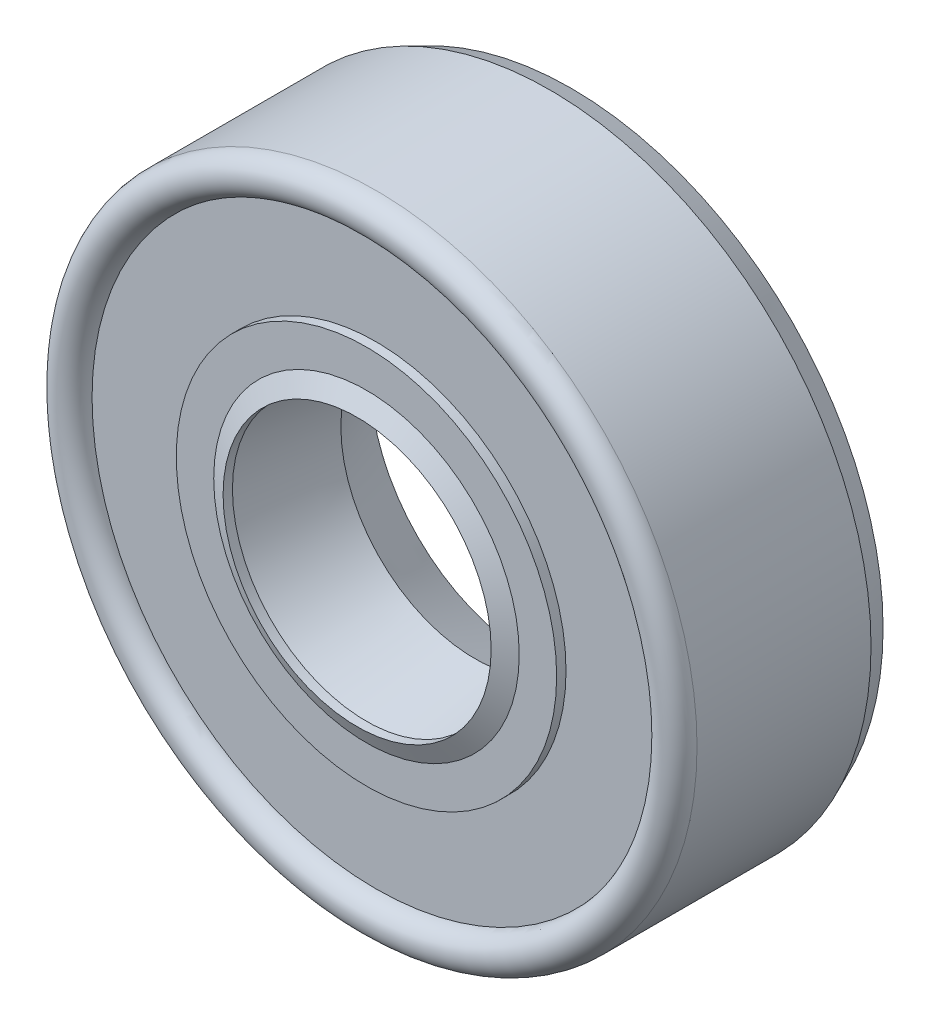
ISO-10303-21;
HEADER;
FILE_DESCRIPTION(('STEP AP214'),'2;1');
FILE_NAME('part.step','',(''),(''),'','','');
FILE_SCHEMA(('AUTOMOTIVE_DESIGN { 1 0 10303 214 1 1 1 1 }'));
ENDSEC;
DATA;
#1=APPLICATION_CONTEXT('core data for automotive mechanical design processes');
#2=APPLICATION_PROTOCOL_DEFINITION('international standard','automotive_design',2000,#1);
#3=PRODUCT_CONTEXT('',#1,'mechanical');
#4=PRODUCT('Part','Part','',(#3));
#5=PRODUCT_RELATED_PRODUCT_CATEGORY('part','',(#4));
#6=PRODUCT_DEFINITION_FORMATION('','',#4);
#7=PRODUCT_DEFINITION_CONTEXT('part definition',#1,'design');
#8=PRODUCT_DEFINITION('design','',#6,#7);
#9=PRODUCT_DEFINITION_SHAPE('','',#8);
#10=(LENGTH_UNIT() NAMED_UNIT(*) SI_UNIT(.MILLI.,.METRE.));
#11=(NAMED_UNIT(*) PLANE_ANGLE_UNIT() SI_UNIT($,.RADIAN.));
#12=(NAMED_UNIT(*) SI_UNIT($,.STERADIAN.) SOLID_ANGLE_UNIT());
#13=UNCERTAINTY_MEASURE_WITH_UNIT(LENGTH_MEASURE(1.E-05),#10,'distance_accuracy_value','');
#14=(GEOMETRIC_REPRESENTATION_CONTEXT(3) GLOBAL_UNCERTAINTY_ASSIGNED_CONTEXT((#13)) GLOBAL_UNIT_ASSIGNED_CONTEXT((#10,
#11,#12)) REPRESENTATION_CONTEXT('',''));
#15=CARTESIAN_POINT('',(0.,0.,0.));
#16=DIRECTION('',(0.,0.,1.));
#17=DIRECTION('',(1.,0.,0.));
#18=AXIS2_PLACEMENT_3D('',#15,#16,#17);
#19=CARTESIAN_POINT('',(0.,0.,-0.35750500000001));
#20=DIRECTION('',(0.,0.,1.));
#21=DIRECTION('',(0.,-1.,0.));
#22=AXIS2_PLACEMENT_3D('',#19,#20,#21);
#23=TOROIDAL_SURFACE('',#22,5.08507999999999,0.554989999999971);
#24=CARTESIAN_POINT('',(0.,-5.64006999999996,-0.35750500000001));
#25=VERTEX_POINT('',#24);
#26=VERTEX_LOOP('',#25);
#27=FACE_BOUND('',#26,.T.);
#28=ADVANCED_FACE('F45',(#27),#23,.T.);
#29=CLOSED_SHELL('',(#28));
#30=MANIFOLD_SOLID_BREP('B2',#29);
#31=CARTESIAN_POINT('',(0.,0.,2.85750000000001));
#32=DIRECTION('',(0.,0.,-1.));
#33=DIRECTION('',(-1.,0.,0.));
#34=AXIS2_PLACEMENT_3D('',#31,#32,#33);
#35=CONICAL_SURFACE('',#34,4.53009,1.10714871779412);
#36=CARTESIAN_POINT('',(0.,0.,3.13499499999999));
#37=DIRECTION('',(0.,0.,1.));
#38=DIRECTION('',(1.,0.,0.));
#39=AXIS2_PLACEMENT_3D('',#36,#37,#38);
#40=CIRCLE('',#39,3.9751);
#41=CARTESIAN_POINT('',(3.9751,0.,3.13499499999999));
#42=VERTEX_POINT('',#41);
#43=EDGE_CURVE('E44',#42,#42,#40,.T.);
#44=ORIENTED_EDGE('',*,*,#43,.F.);
#45=EDGE_LOOP('',(#44));
#46=FACE_BOUND('',#45,.T.);
#47=CARTESIAN_POINT('',(0.,0.,2.85750000000001));
#48=DIRECTION('',(0.,0.,1.));
#49=DIRECTION('',(1.,0.,0.));
#50=AXIS2_PLACEMENT_3D('',#47,#48,#49);
#51=CIRCLE('',#50,4.53009);
#52=CARTESIAN_POINT('',(4.53009,0.,2.85750000000001));
#53=VERTEX_POINT('',#52);
#54=EDGE_CURVE('E136',#53,#53,#51,.T.);
#55=ORIENTED_EDGE('',*,*,#54,.T.);
#56=EDGE_LOOP('',(#55));
#57=FACE_BOUND('',#56,.T.);
#58=ADVANCED_FACE('F66',(#46,#57),#35,.T.);
#59=CARTESIAN_POINT('',(0.,0.,-3.13499499999999));
#60=DIRECTION('',(0.,0.,1.));
#61=DIRECTION('',(1.,0.,0.));
#62=AXIS2_PLACEMENT_3D('',#59,#60,#61);
#63=CYLINDRICAL_SURFACE('',#62,3.9751);
#64=CARTESIAN_POINT('',(0.,0.,2.85749999999998));
#65=DIRECTION('',(0.,0.,1.));
#66=DIRECTION('',(1.,0.,0.));
#67=AXIS2_PLACEMENT_3D('',#64,#65,#66);
#68=CIRCLE('',#67,3.97509999999999);
#69=CARTESIAN_POINT('',(3.97509999999999,0.,2.85749999999998));
#70=VERTEX_POINT('',#69);
#71=EDGE_CURVE('E72',#70,#70,#68,.T.);
#72=ORIENTED_EDGE('',*,*,#71,.F.);
#73=EDGE_LOOP('',(#72));
#74=FACE_BOUND('',#73,.T.);
#75=ORIENTED_EDGE('',*,*,#43,.T.);
#76=EDGE_LOOP('',(#75));
#77=FACE_BOUND('',#76,.T.);
#78=ADVANCED_FACE('F257',(#74,#77),#63,.F.);
#79=CARTESIAN_POINT('',(0.,0.,2.85749999999998));
#80=DIRECTION('',(0.,0.,-1.));
#81=DIRECTION('',(-1.,0.,0.));
#82=AXIS2_PLACEMENT_3D('',#79,#80,#81);
#83=CONICAL_SURFACE('',#82,3.97509999999999,1.10714871779412);
#84=CARTESIAN_POINT('',(0.,0.,2.58000500000002));
#85=DIRECTION('',(0.,0.,1.));
#86=DIRECTION('',(1.,0.,0.));
#87=AXIS2_PLACEMENT_3D('',#84,#85,#86);
#88=CIRCLE('',#87,4.53008999999996);
#89=CARTESIAN_POINT('',(4.53008999999996,0.,2.58000500000002));
#90=VERTEX_POINT('',#89);
#91=EDGE_CURVE('E76',#90,#90,#88,.T.);
#92=ORIENTED_EDGE('',*,*,#91,.F.);
#93=EDGE_LOOP('',(#92));
#94=FACE_BOUND('',#93,.T.);
#95=ORIENTED_EDGE('',*,*,#71,.T.);
#96=EDGE_LOOP('',(#95));
#97=FACE_BOUND('',#96,.T.);
#98=ADVANCED_FACE('F252',(#94,#97),#83,.F.);
#99=CARTESIAN_POINT('',(0.,0.,2.58000500000002));
#100=DIRECTION('',(0.,0.,1.));
#101=DIRECTION('',(1.,0.,0.));
#102=AXIS2_PLACEMENT_3D('',#99,#100,#101);
#103=CONICAL_SURFACE('',#102,4.53008999999996,0.186731074978148);
#104=CARTESIAN_POINT('',(0.,0.,-0.357505000000009));
#105=DIRECTION('',(0.,0.,1.));
#106=DIRECTION('',(1.,0.,0.));
#107=AXIS2_PLACEMENT_3D('',#104,#105,#106);
#108=CIRCLE('',#107,3.97509999999999);
#109=CARTESIAN_POINT('',(3.97509999999999,0.,-0.357505000000009));
#110=VERTEX_POINT('',#109);
#111=EDGE_CURVE('E80',#110,#110,#108,.T.);
#112=ORIENTED_EDGE('',*,*,#111,.F.);
#113=EDGE_LOOP('',(#112));
#114=FACE_BOUND('',#113,.T.);
#115=ORIENTED_EDGE('',*,*,#91,.T.);
#116=EDGE_LOOP('',(#115));
#117=FACE_BOUND('',#116,.T.);
#118=ADVANCED_FACE('F246',(#114,#117),#103,.F.);
#119=CARTESIAN_POINT('',(0.,0.,-0.357505000000009));
#120=DIRECTION('',(0.,0.,-1.));
#121=DIRECTION('',(-1.,0.,0.));
#122=AXIS2_PLACEMENT_3D('',#119,#120,#121);
#123=CONICAL_SURFACE('',#122,3.97509999999999,0.453924654369483);
#124=CARTESIAN_POINT('',(0.,0.,-2.06374999999999));
#125=DIRECTION('',(0.,0.,1.));
#126=DIRECTION('',(1.,0.,0.));
#127=AXIS2_PLACEMENT_3D('',#124,#125,#126);
#128=CIRCLE('',#127,4.80758499999999);
#129=CARTESIAN_POINT('',(4.80758499999999,0.,-2.06374999999999));
#130=VERTEX_POINT('',#129);
#131=EDGE_CURVE('E85',#130,#130,#128,.T.);
#132=ORIENTED_EDGE('',*,*,#131,.F.);
#133=EDGE_LOOP('',(#132));
#134=FACE_BOUND('',#133,.T.);
#135=ORIENTED_EDGE('',*,*,#111,.T.);
#136=EDGE_LOOP('',(#135));
#137=FACE_BOUND('',#136,.T.);
#138=ADVANCED_FACE('F240',(#134,#137),#123,.F.);
#139=CARTESIAN_POINT('',(0.,4.80758499999999,-2.06374999999999));
#140=DIRECTION('',(0.,0.,1.));
#141=DIRECTION('',(1.,0.,0.));
#142=AXIS2_PLACEMENT_3D('',#139,#140,#141);
#143=PLANE('',#142);
#144=CARTESIAN_POINT('',(0.,0.,-2.06374999999999));
#145=DIRECTION('',(0.,0.,1.));
#146=DIRECTION('',(1.,0.,0.));
#147=AXIS2_PLACEMENT_3D('',#144,#145,#146);
#148=CIRCLE('',#147,5.08507999999999);
#149=CARTESIAN_POINT('',(5.08507999999999,0.,-2.06374999999999));
#150=VERTEX_POINT('',#149);
#151=EDGE_CURVE('E88',#150,#150,#148,.T.);
#152=ORIENTED_EDGE('',*,*,#151,.F.);
#153=EDGE_LOOP('',(#152));
#154=FACE_BOUND('',#153,.T.);
#155=ORIENTED_EDGE('',*,*,#131,.T.);
#156=EDGE_LOOP('',(#155));
#157=FACE_BOUND('',#156,.T.);
#158=ADVANCED_FACE('F234',(#154,#157),#143,.F.);
#159=CARTESIAN_POINT('',(0.,0.,-3.13499499999999));
#160=DIRECTION('',(0.,0.,1.));
#161=DIRECTION('',(1.,0.,0.));
#162=AXIS2_PLACEMENT_3D('',#159,#160,#161);
#163=CYLINDRICAL_SURFACE('',#162,5.08507999999999);
#164=CARTESIAN_POINT('',(0.,0.,-0.91249499999998));
#165=DIRECTION('',(0.,0.,1.));
#166=DIRECTION('',(1.,0.,0.));
#167=AXIS2_PLACEMENT_3D('',#164,#165,#166);
#168=CIRCLE('',#167,5.08507999999999);
#169=CARTESIAN_POINT('',(5.08507999999999,0.,-0.91249499999998));
#170=VERTEX_POINT('',#169);
#171=EDGE_CURVE('E91',#170,#170,#168,.T.);
#172=ORIENTED_EDGE('',*,*,#171,.F.);
#173=EDGE_LOOP('',(#172));
#174=FACE_BOUND('',#173,.T.);
#175=ORIENTED_EDGE('',*,*,#151,.T.);
#176=EDGE_LOOP('',(#175));
#177=FACE_BOUND('',#176,.T.);
#178=ADVANCED_FACE('F228',(#174,#177),#163,.T.);
#179=CARTESIAN_POINT('',(0.,0.,-0.357505000000009));
#180=DIRECTION('',(0.,0.,1.));
#181=DIRECTION('',(1.,0.,0.));
#182=AXIS2_PLACEMENT_3D('',#179,#180,#181);
#183=TOROIDAL_SURFACE('',#182,5.08507999999999,0.554989999999971);
#184=CARTESIAN_POINT('',(0.,0.,0.197484999999962));
#185=DIRECTION('',(0.,0.,1.));
#186=DIRECTION('',(1.,0.,0.));
#187=AXIS2_PLACEMENT_3D('',#184,#185,#186);
#188=CIRCLE('',#187,5.08507999999999);
#189=CARTESIAN_POINT('',(5.08507999999999,0.,0.197484999999962));
#190=VERTEX_POINT('',#189);
#191=EDGE_CURVE('E94',#190,#190,#188,.T.);
#192=ORIENTED_EDGE('',*,*,#191,.F.);
#193=EDGE_LOOP('',(#192));
#194=FACE_BOUND('',#193,.T.);
#195=ORIENTED_EDGE('',*,*,#171,.T.);
#196=EDGE_LOOP('',(#195));
#197=FACE_BOUND('',#196,.T.);
#198=ADVANCED_FACE('F222',(#194,#197),#183,.F.);
#199=CARTESIAN_POINT('',(0.,0.,-3.13499499999999));
#200=DIRECTION('',(0.,0.,1.));
#201=DIRECTION('',(1.,0.,0.));
#202=AXIS2_PLACEMENT_3D('',#199,#200,#201);
#203=CYLINDRICAL_SURFACE('',#202,5.08507999999999);
#204=CARTESIAN_POINT('',(0.,0.,2.02501500000003));
#205=DIRECTION('',(0.,0.,1.));
#206=DIRECTION('',(1.,0.,0.));
#207=AXIS2_PLACEMENT_3D('',#204,#205,#206);
#208=CIRCLE('',#207,5.08507999999999);
#209=CARTESIAN_POINT('',(5.08507999999999,0.,2.02501500000003));
#210=VERTEX_POINT('',#209);
#211=EDGE_CURVE('E97',#210,#210,#208,.T.);
#212=ORIENTED_EDGE('',*,*,#211,.F.);
#213=EDGE_LOOP('',(#212));
#214=FACE_BOUND('',#213,.T.);
#215=ORIENTED_EDGE('',*,*,#191,.T.);
#216=EDGE_LOOP('',(#215));
#217=FACE_BOUND('',#216,.T.);
#218=ADVANCED_FACE('F216',(#214,#217),#203,.T.);
#219=CARTESIAN_POINT('',(0.,5.08507999999999,2.02501500000003));
#220=DIRECTION('',(0.,0.,1.));
#221=DIRECTION('',(1.,0.,0.));
#222=AXIS2_PLACEMENT_3D('',#219,#220,#221);
#223=PLANE('',#222);
#224=CARTESIAN_POINT('',(0.,0.,2.02501500000003));
#225=DIRECTION('',(0.,0.,1.));
#226=DIRECTION('',(1.,0.,0.));
#227=AXIS2_PLACEMENT_3D('',#224,#225,#226);
#228=CIRCLE('',#227,8.97001000000001);
#229=CARTESIAN_POINT('',(8.97001000000001,0.,2.02501500000003));
#230=VERTEX_POINT('',#229);
#231=EDGE_CURVE('E100',#230,#230,#228,.T.);
#232=ORIENTED_EDGE('',*,*,#231,.F.);
#233=EDGE_LOOP('',(#232));
#234=FACE_BOUND('',#233,.T.);
#235=ORIENTED_EDGE('',*,*,#211,.T.);
#236=EDGE_LOOP('',(#235));
#237=FACE_BOUND('',#236,.T.);
#238=ADVANCED_FACE('F210',(#234,#237),#223,.F.);
#239=CARTESIAN_POINT('',(0.,0.,-3.13499499999999));
#240=DIRECTION('',(0.,0.,1.));
#241=DIRECTION('',(1.,0.,0.));
#242=AXIS2_PLACEMENT_3D('',#239,#240,#241);
#243=CYLINDRICAL_SURFACE('',#242,8.97001);
#244=CARTESIAN_POINT('',(0.,0.,-1.94500500000001));
#245=DIRECTION('',(0.,0.,1.));
#246=DIRECTION('',(1.,0.,0.));
#247=AXIS2_PLACEMENT_3D('',#244,#245,#246);
#248=CIRCLE('',#247,8.97000999999999);
#249=CARTESIAN_POINT('',(8.97000999999999,0.,-1.94500500000001));
#250=VERTEX_POINT('',#249);
#251=EDGE_CURVE('E103',#250,#250,#248,.T.);
#252=ORIENTED_EDGE('',*,*,#251,.F.);
#253=EDGE_LOOP('',(#252));
#254=FACE_BOUND('',#253,.T.);
#255=ORIENTED_EDGE('',*,*,#231,.T.);
#256=EDGE_LOOP('',(#255));
#257=FACE_BOUND('',#256,.T.);
#258=ADVANCED_FACE('F204',(#254,#257),#243,.F.);
#259=CARTESIAN_POINT('',(0.,8.97000999999999,-1.94500500000001));
#260=DIRECTION('',(0.,0.,1.));
#261=DIRECTION('',(1.,0.,0.));
#262=AXIS2_PLACEMENT_3D('',#259,#260,#261);
#263=PLANE('',#262);
#264=CARTESIAN_POINT('',(0.,0.,-1.94500500000001));
#265=DIRECTION('',(0.,0.,1.));
#266=DIRECTION('',(1.,0.,0.));
#267=AXIS2_PLACEMENT_3D('',#264,#265,#266);
#268=CIRCLE('',#267,9.1087575);
#269=CARTESIAN_POINT('',(9.1087575,0.,-1.94500500000001));
#270=VERTEX_POINT('',#269);
#271=EDGE_CURVE('E106',#270,#270,#268,.T.);
#272=ORIENTED_EDGE('',*,*,#271,.F.);
#273=EDGE_LOOP('',(#272));
#274=FACE_BOUND('',#273,.T.);
#275=ORIENTED_EDGE('',*,*,#251,.T.);
#276=EDGE_LOOP('',(#275));
#277=FACE_BOUND('',#276,.T.);
#278=ADVANCED_FACE('F198',(#274,#277),#263,.F.);
#279=CARTESIAN_POINT('',(0.,0.,-3.13499499999999));
#280=DIRECTION('',(0.,0.,1.));
#281=DIRECTION('',(1.,0.,0.));
#282=AXIS2_PLACEMENT_3D('',#279,#280,#281);
#283=CYLINDRICAL_SURFACE('',#282,9.1087575);
#284=CARTESIAN_POINT('',(0.,0.,-2.58000500000001));
#285=DIRECTION('',(0.,0.,1.));
#286=DIRECTION('',(1.,0.,0.));
#287=AXIS2_PLACEMENT_3D('',#284,#285,#286);
#288=CIRCLE('',#287,9.1087575);
#289=CARTESIAN_POINT('',(9.1087575,0.,-2.58000500000001));
#290=VERTEX_POINT('',#289);
#291=EDGE_CURVE('E109',#290,#290,#288,.T.);
#292=ORIENTED_EDGE('',*,*,#291,.F.);
#293=EDGE_LOOP('',(#292));
#294=FACE_BOUND('',#293,.T.);
#295=ORIENTED_EDGE('',*,*,#271,.T.);
#296=EDGE_LOOP('',(#295));
#297=FACE_BOUND('',#296,.T.);
#298=ADVANCED_FACE('F192',(#294,#297),#283,.F.);
#299=CARTESIAN_POINT('',(0.,9.1087575,-2.58000500000002));
#300=DIRECTION('',(0.,0.,-1.));
#301=DIRECTION('',(-1.,0.,0.));
#302=AXIS2_PLACEMENT_3D('',#299,#300,#301);
#303=PLANE('',#302);
#304=CARTESIAN_POINT('',(0.,0.,-2.58000500000002));
#305=DIRECTION('',(0.,0.,1.));
#306=DIRECTION('',(1.,0.,0.));
#307=AXIS2_PLACEMENT_3D('',#304,#305,#306);
#308=CIRCLE('',#307,8.97000999999999);
#309=CARTESIAN_POINT('',(8.97000999999999,0.,-2.58000500000002));
#310=VERTEX_POINT('',#309);
#311=EDGE_CURVE('E112',#310,#310,#308,.T.);
#312=ORIENTED_EDGE('',*,*,#311,.F.);
#313=EDGE_LOOP('',(#312));
#314=FACE_BOUND('',#313,.T.);
#315=ORIENTED_EDGE('',*,*,#291,.T.);
#316=EDGE_LOOP('',(#315));
#317=FACE_BOUND('',#316,.T.);
#318=ADVANCED_FACE('F186',(#314,#317),#303,.F.);
#319=CARTESIAN_POINT('',(0.,0.,-3.13499499999999));
#320=DIRECTION('',(0.,0.,1.));
#321=DIRECTION('',(1.,0.,0.));
#322=AXIS2_PLACEMENT_3D('',#319,#320,#321);
#323=CYLINDRICAL_SURFACE('',#322,8.97001);
#324=CARTESIAN_POINT('',(0.,0.,-3.21500500000001));
#325=DIRECTION('',(0.,0.,1.));
#326=DIRECTION('',(1.,0.,0.));
#327=AXIS2_PLACEMENT_3D('',#324,#325,#326);
#328=CIRCLE('',#327,8.97001);
#329=CARTESIAN_POINT('',(8.97001,0.,-3.21500500000001));
#330=VERTEX_POINT('',#329);
#331=EDGE_CURVE('E115',#330,#330,#328,.T.);
#332=ORIENTED_EDGE('',*,*,#331,.F.);
#333=EDGE_LOOP('',(#332));
#334=FACE_BOUND('',#333,.T.);
#335=ORIENTED_EDGE('',*,*,#311,.T.);
#336=EDGE_LOOP('',(#335));
#337=FACE_BOUND('',#336,.T.);
#338=ADVANCED_FACE('F180',(#334,#337),#323,.F.);
#339=CARTESIAN_POINT('',(0.,8.97001,-3.21500500000001));
#340=DIRECTION('',(0.,0.,1.));
#341=DIRECTION('',(1.,0.,0.));
#342=AXIS2_PLACEMENT_3D('',#339,#340,#341);
#343=PLANE('',#342);
#344=CARTESIAN_POINT('',(0.,0.,-3.21500500000001));
#345=DIRECTION('',(0.,0.,1.));
#346=DIRECTION('',(1.,0.,0.));
#347=AXIS2_PLACEMENT_3D('',#344,#345,#346);
#348=CIRCLE('',#347,9.247505);
#349=CARTESIAN_POINT('',(9.247505,0.,-3.21500500000001));
#350=VERTEX_POINT('',#349);
#351=EDGE_CURVE('E118',#350,#350,#348,.T.);
#352=ORIENTED_EDGE('',*,*,#351,.F.);
#353=EDGE_LOOP('',(#352));
#354=FACE_BOUND('',#353,.T.);
#355=ORIENTED_EDGE('',*,*,#331,.T.);
#356=EDGE_LOOP('',(#355));
#357=FACE_BOUND('',#356,.T.);
#358=ADVANCED_FACE('F174',(#354,#357),#343,.F.);
#359=CARTESIAN_POINT('',(0.,0.,-3.21500500000001));
#360=DIRECTION('',(0.,0.,1.));
#361=DIRECTION('',(1.,0.,0.));
#362=AXIS2_PLACEMENT_3D('',#359,#360,#361);
#363=CONICAL_SURFACE('',#362,9.247505,0.411990692422189);
#364=CARTESIAN_POINT('',(0.,0.,-2.58000500000004));
#365=DIRECTION('',(0.,0.,1.));
#366=DIRECTION('',(1.,0.,0.));
#367=AXIS2_PLACEMENT_3D('',#364,#365,#366);
#368=CIRCLE('',#367,9.52499999999999);
#369=CARTESIAN_POINT('',(9.52499999999999,0.,-2.58000500000004));
#370=VERTEX_POINT('',#369);
#371=EDGE_CURVE('E121',#370,#370,#368,.T.);
#372=ORIENTED_EDGE('',*,*,#371,.F.);
#373=EDGE_LOOP('',(#372));
#374=FACE_BOUND('',#373,.T.);
#375=ORIENTED_EDGE('',*,*,#351,.T.);
#376=EDGE_LOOP('',(#375));
#377=FACE_BOUND('',#376,.T.);
#378=ADVANCED_FACE('F168',(#374,#377),#363,.T.);
#379=CARTESIAN_POINT('',(0.,0.,-3.13499499999999));
#380=DIRECTION('',(0.,0.,1.));
#381=DIRECTION('',(1.,0.,0.));
#382=AXIS2_PLACEMENT_3D('',#379,#380,#381);
#383=CYLINDRICAL_SURFACE('',#382,9.52499999999999);
#384=CARTESIAN_POINT('',(0.,0.,2.58000500000003));
#385=DIRECTION('',(0.,0.,1.));
#386=DIRECTION('',(1.,0.,0.));
#387=AXIS2_PLACEMENT_3D('',#384,#385,#386);
#388=CIRCLE('',#387,9.52499999999999);
#389=CARTESIAN_POINT('',(9.52499999999999,0.,2.58000500000003));
#390=VERTEX_POINT('',#389);
#391=EDGE_CURVE('E124',#390,#390,#388,.T.);
#392=ORIENTED_EDGE('',*,*,#391,.F.);
#393=EDGE_LOOP('',(#392));
#394=FACE_BOUND('',#393,.T.);
#395=ORIENTED_EDGE('',*,*,#371,.T.);
#396=EDGE_LOOP('',(#395));
#397=FACE_BOUND('',#396,.T.);
#398=ADVANCED_FACE('F162',(#394,#397),#383,.T.);
#399=CARTESIAN_POINT('',(0.,0.,2.58000500000001));
#400=DIRECTION('',(0.,0.,1.));
#401=DIRECTION('',(1.,0.,0.));
#402=AXIS2_PLACEMENT_3D('',#399,#400,#401);
#403=TOROIDAL_SURFACE('',#402,8.97000999999999,0.554989999999983);
#404=CARTESIAN_POINT('',(0.,0.,2.58000500000003));
#405=DIRECTION('',(0.,0.,1.));
#406=DIRECTION('',(1.,0.,0.));
#407=AXIS2_PLACEMENT_3D('',#404,#405,#406);
#408=CIRCLE('',#407,8.41502000000001);
#409=CARTESIAN_POINT('',(8.41502000000001,0.,2.58000500000003));
#410=VERTEX_POINT('',#409);
#411=EDGE_CURVE('E127',#410,#410,#408,.T.);
#412=ORIENTED_EDGE('',*,*,#411,.F.);
#413=EDGE_LOOP('',(#412));
#414=FACE_BOUND('',#413,.T.);
#415=ORIENTED_EDGE('',*,*,#391,.T.);
#416=EDGE_LOOP('',(#415));
#417=FACE_BOUND('',#416,.T.);
#418=ADVANCED_FACE('F156',(#414,#417),#403,.T.);
#419=CARTESIAN_POINT('',(0.,8.41502000000003,2.58000500000002));
#420=DIRECTION('',(0.,0.,-1.));
#421=DIRECTION('',(-1.,0.,0.));
#422=AXIS2_PLACEMENT_3D('',#419,#420,#421);
#423=PLANE('',#422);
#424=CARTESIAN_POINT('',(0.,0.,2.58000500000002));
#425=DIRECTION('',(0.,0.,1.));
#426=DIRECTION('',(1.,0.,0.));
#427=AXIS2_PLACEMENT_3D('',#424,#425,#426);
#428=CIRCLE('',#427,5.64006999999997);
#429=CARTESIAN_POINT('',(5.64006999999997,0.,2.58000500000002));
#430=VERTEX_POINT('',#429);
#431=EDGE_CURVE('E130',#430,#430,#428,.T.);
#432=ORIENTED_EDGE('',*,*,#431,.F.);
#433=EDGE_LOOP('',(#432));
#434=FACE_BOUND('',#433,.T.);
#435=ORIENTED_EDGE('',*,*,#411,.T.);
#436=EDGE_LOOP('',(#435));
#437=FACE_BOUND('',#436,.T.);
#438=ADVANCED_FACE('F150',(#434,#437),#423,.F.);
#439=CARTESIAN_POINT('',(0.,0.,-3.13499499999999));
#440=DIRECTION('',(0.,0.,1.));
#441=DIRECTION('',(1.,0.,0.));
#442=AXIS2_PLACEMENT_3D('',#439,#440,#441);
#443=CYLINDRICAL_SURFACE('',#442,5.64006999999997);
#444=CARTESIAN_POINT('',(0.,0.,2.85750000000001));
#445=DIRECTION('',(0.,0.,1.));
#446=DIRECTION('',(1.,0.,0.));
#447=AXIS2_PLACEMENT_3D('',#444,#445,#446);
#448=CIRCLE('',#447,5.64006999999997);
#449=CARTESIAN_POINT('',(5.64006999999997,0.,2.85750000000001));
#450=VERTEX_POINT('',#449);
#451=EDGE_CURVE('E133',#450,#450,#448,.T.);
#452=ORIENTED_EDGE('',*,*,#451,.F.);
#453=EDGE_LOOP('',(#452));
#454=FACE_BOUND('',#453,.T.);
#455=ORIENTED_EDGE('',*,*,#431,.T.);
#456=EDGE_LOOP('',(#455));
#457=FACE_BOUND('',#456,.T.);
#458=ADVANCED_FACE('F144',(#454,#457),#443,.T.);
#459=CARTESIAN_POINT('',(0.,5.64006999999997,2.85750000000001));
#460=DIRECTION('',(0.,0.,-1.));
#461=DIRECTION('',(-1.,0.,0.));
#462=AXIS2_PLACEMENT_3D('',#459,#460,#461);
#463=PLANE('',#462);
#464=ORIENTED_EDGE('',*,*,#54,.F.);
#465=EDGE_LOOP('',(#464));
#466=FACE_BOUND('',#465,.T.);
#467=ORIENTED_EDGE('',*,*,#451,.T.);
#468=EDGE_LOOP('',(#467));
#469=FACE_BOUND('',#468,.T.);
#470=ADVANCED_FACE('F141',(#466,#469),#463,.F.);
#471=CLOSED_SHELL('',(#58,#78,#98,#118,#138,#158,#178,#198,#218,#238,#258,#278,#298,#318,#338,
#358,#378,#398,#418,#438,#458,#470));
#472=MANIFOLD_SOLID_BREP('B6',#471);
#473=ADVANCED_BREP_SHAPE_REPRESENTATION('',(#18,#30,#472),#14);
#474=SHAPE_DEFINITION_REPRESENTATION(#9,#473);
ENDSEC;
END-ISO-10303-21;
